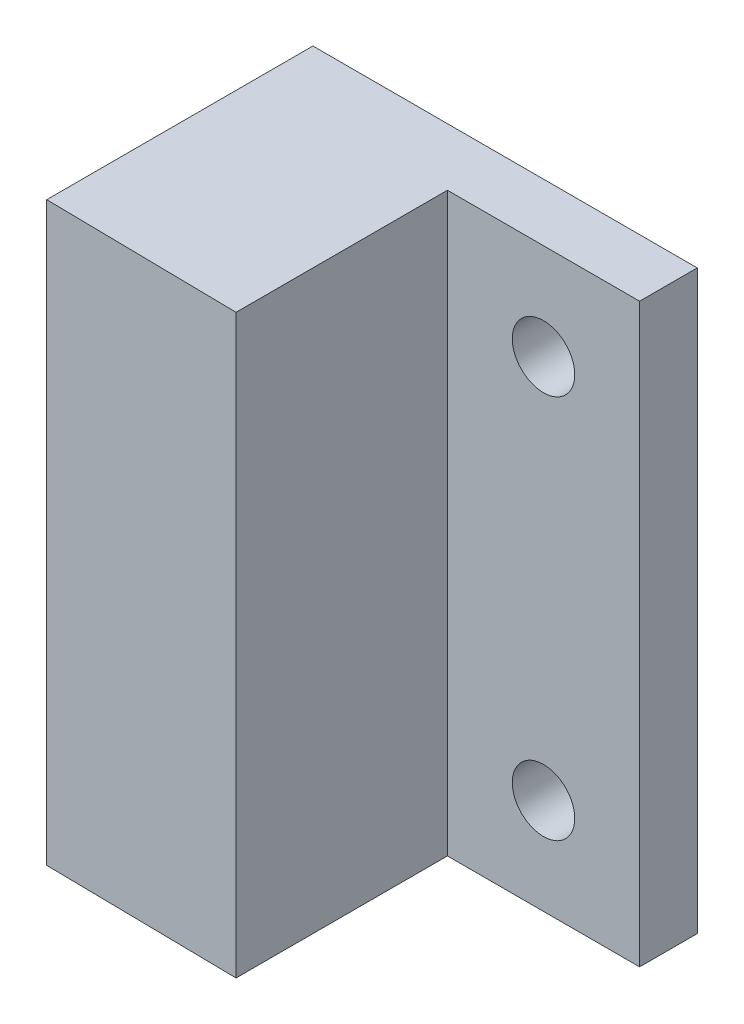
ISO-10303-21;
HEADER;
FILE_DESCRIPTION(('STEP AP214'),'2;1');
FILE_NAME('part.step','',(''),(''),'','','');
FILE_SCHEMA(('AUTOMOTIVE_DESIGN { 1 0 10303 214 1 1 1 1 }'));
ENDSEC;
DATA;
#1=APPLICATION_CONTEXT('core data for automotive mechanical design processes');
#2=APPLICATION_PROTOCOL_DEFINITION('international standard','automotive_design',2000,#1);
#3=PRODUCT_CONTEXT('',#1,'mechanical');
#4=PRODUCT('Part','Part','',(#3));
#5=PRODUCT_RELATED_PRODUCT_CATEGORY('part','',(#4));
#6=PRODUCT_DEFINITION_FORMATION('','',#4);
#7=PRODUCT_DEFINITION_CONTEXT('part definition',#1,'design');
#8=PRODUCT_DEFINITION('design','',#6,#7);
#9=PRODUCT_DEFINITION_SHAPE('','',#8);
#10=(LENGTH_UNIT() NAMED_UNIT(*) SI_UNIT(.MILLI.,.METRE.));
#11=(NAMED_UNIT(*) PLANE_ANGLE_UNIT() SI_UNIT($,.RADIAN.));
#12=(NAMED_UNIT(*) SI_UNIT($,.STERADIAN.) SOLID_ANGLE_UNIT());
#13=UNCERTAINTY_MEASURE_WITH_UNIT(LENGTH_MEASURE(1.E-05),#10,'distance_accuracy_value','');
#14=(GEOMETRIC_REPRESENTATION_CONTEXT(3) GLOBAL_UNCERTAINTY_ASSIGNED_CONTEXT((#13)) GLOBAL_UNIT_ASSIGNED_CONTEXT((#10,
#11,#12)) REPRESENTATION_CONTEXT('',''));
#15=CARTESIAN_POINT('',(0.,0.,0.));
#16=DIRECTION('',(0.,0.,1.));
#17=DIRECTION('',(1.,0.,0.));
#18=AXIS2_PLACEMENT_3D('',#15,#16,#17);
#19=CARTESIAN_POINT('',(10.,0.,14.));
#20=DIRECTION('',(-1.,0.,0.));
#21=DIRECTION('',(0.,-1.,0.));
#22=AXIS2_PLACEMENT_3D('',#19,#20,#21);
#23=PLANE('',#22);
#24=DIRECTION('',(0.,-1.,0.));
#25=VECTOR('',#24,1.);
#26=CARTESIAN_POINT('',(10.,0.,3.));
#27=LINE('',#26,#25);
#28=CARTESIAN_POINT('',(10.,0.,3.));
#29=VERTEX_POINT('',#28);
#30=CARTESIAN_POINT('',(10.,-30.,3.));
#31=VERTEX_POINT('',#30);
#32=EDGE_CURVE('E48',#29,#31,#27,.T.);
#33=ORIENTED_EDGE('',*,*,#32,.F.);
#34=DIRECTION('',(0.,0.,-1.));
#35=VECTOR('',#34,1.);
#36=CARTESIAN_POINT('',(10.,0.,14.));
#37=LINE('',#36,#35);
#38=CARTESIAN_POINT('',(10.,0.,14.));
#39=VERTEX_POINT('',#38);
#40=EDGE_CURVE('E102',#39,#29,#37,.T.);
#41=ORIENTED_EDGE('',*,*,#40,.F.);
#42=DIRECTION('',(0.,1.,0.));
#43=VECTOR('',#42,1.);
#44=CARTESIAN_POINT('',(10.,0.,14.));
#45=LINE('',#44,#43);
#46=CARTESIAN_POINT('',(10.,-30.,14.));
#47=VERTEX_POINT('',#46);
#48=EDGE_CURVE('E90',#47,#39,#45,.T.);
#49=ORIENTED_EDGE('',*,*,#48,.F.);
#50=DIRECTION('',(0.,0.,-1.));
#51=VECTOR('',#50,1.);
#52=CARTESIAN_POINT('',(10.,-30.,14.));
#53=LINE('',#52,#51);
#54=EDGE_CURVE('E41',#47,#31,#53,.T.);
#55=ORIENTED_EDGE('',*,*,#54,.T.);
#56=EDGE_LOOP('',(#33,#41,#49,#55));
#57=FACE_BOUND('',#56,.T.);
#58=ADVANCED_FACE('F33',(#57),#23,.F.);
#59=CARTESIAN_POINT('',(0.,0.,14.));
#60=DIRECTION('',(1.,0.,0.));
#61=DIRECTION('',(0.,1.,0.));
#62=AXIS2_PLACEMENT_3D('',#59,#60,#61);
#63=PLANE('',#62);
#64=DIRECTION('',(0.,0.,-1.));
#65=VECTOR('',#64,1.);
#66=CARTESIAN_POINT('',(0.,-30.,14.));
#67=LINE('',#66,#65);
#68=CARTESIAN_POINT('',(0.,-30.,13.85));
#69=VERTEX_POINT('',#68);
#70=CARTESIAN_POINT('',(0.,-30.,0.));
#71=VERTEX_POINT('',#70);
#72=EDGE_CURVE('E11',#69,#71,#67,.T.);
#73=ORIENTED_EDGE('',*,*,#72,.F.);
#74=DIRECTION('',(0.,-1.,0.));
#75=VECTOR('',#74,1.);
#76=CARTESIAN_POINT('',(0.,0.,13.85));
#77=LINE('',#76,#75);
#78=CARTESIAN_POINT('',(0.,0.,13.85));
#79=VERTEX_POINT('',#78);
#80=EDGE_CURVE('E105',#79,#69,#77,.T.);
#81=ORIENTED_EDGE('',*,*,#80,.F.);
#82=DIRECTION('',(0.,0.,-1.));
#83=VECTOR('',#82,1.);
#84=CARTESIAN_POINT('',(0.,0.,14.));
#85=LINE('',#84,#83);
#86=CARTESIAN_POINT('',(0.,0.,0.));
#87=VERTEX_POINT('',#86);
#88=EDGE_CURVE('E95',#79,#87,#85,.T.);
#89=ORIENTED_EDGE('',*,*,#88,.T.);
#90=DIRECTION('',(0.,-1.,0.));
#91=VECTOR('',#90,1.);
#92=CARTESIAN_POINT('',(0.,0.,0.));
#93=LINE('',#92,#91);
#94=EDGE_CURVE('E112',#87,#71,#93,.T.);
#95=ORIENTED_EDGE('',*,*,#94,.T.);
#96=EDGE_LOOP('',(#73,#81,#89,#95));
#97=FACE_BOUND('',#96,.T.);
#98=ADVANCED_FACE('F35',(#97),#63,.F.);
#99=CARTESIAN_POINT('',(0.,-30.,14.));
#100=DIRECTION('',(0.,1.,0.));
#101=DIRECTION('',(0.,0.,1.));
#102=AXIS2_PLACEMENT_3D('',#99,#100,#101);
#103=PLANE('',#102);
#104=ORIENTED_EDGE('',*,*,#54,.F.);
#105=DIRECTION('',(0.999887518980816,0.,0.0149983127847123));
#106=VECTOR('',#105,1.);
#107=CARTESIAN_POINT('',(0.,-30.,13.85));
#108=LINE('',#107,#106);
#109=EDGE_CURVE('E57',#69,#47,#108,.T.);
#110=ORIENTED_EDGE('',*,*,#109,.F.);
#111=ORIENTED_EDGE('',*,*,#72,.T.);
#112=DIRECTION('',(1.,0.,0.));
#113=VECTOR('',#112,1.);
#114=CARTESIAN_POINT('',(0.,-30.,0.));
#115=LINE('',#114,#113);
#116=CARTESIAN_POINT('',(20.,-30.,0.));
#117=VERTEX_POINT('',#116);
#118=EDGE_CURVE('E72',#71,#117,#115,.T.);
#119=ORIENTED_EDGE('',*,*,#118,.T.);
#120=DIRECTION('',(0.,0.,-1.));
#121=VECTOR('',#120,1.);
#122=CARTESIAN_POINT('',(20.,-30.,0.));
#123=LINE('',#122,#121);
#124=CARTESIAN_POINT('',(20.,-30.,3.));
#125=VERTEX_POINT('',#124);
#126=EDGE_CURVE('E120',#125,#117,#123,.T.);
#127=ORIENTED_EDGE('',*,*,#126,.F.);
#128=DIRECTION('',(-1.,0.,0.));
#129=VECTOR('',#128,1.);
#130=CARTESIAN_POINT('',(20.,-30.,3.));
#131=LINE('',#130,#129);
#132=EDGE_CURVE('E117',#125,#31,#131,.T.);
#133=ORIENTED_EDGE('',*,*,#132,.T.);
#134=EDGE_LOOP('',(#104,#110,#111,#119,#127,#133));
#135=FACE_BOUND('',#134,.T.);
#136=ADVANCED_FACE('F144',(#135),#103,.F.);
#137=CARTESIAN_POINT('',(0.,0.,14.));
#138=DIRECTION('',(0.,-1.,0.));
#139=DIRECTION('',(0.,0.,-1.));
#140=AXIS2_PLACEMENT_3D('',#137,#138,#139);
#141=PLANE('',#140);
#142=ORIENTED_EDGE('',*,*,#88,.F.);
#143=DIRECTION('',(0.999887518980816,0.,0.0149983127847123));
#144=VECTOR('',#143,1.);
#145=CARTESIAN_POINT('',(0.,0.,13.85));
#146=LINE('',#145,#144);
#147=EDGE_CURVE('E93',#79,#39,#146,.T.);
#148=ORIENTED_EDGE('',*,*,#147,.T.);
#149=ORIENTED_EDGE('',*,*,#40,.T.);
#150=DIRECTION('',(-1.,0.,0.));
#151=VECTOR('',#150,1.);
#152=CARTESIAN_POINT('',(20.,0.,3.));
#153=LINE('',#152,#151);
#154=CARTESIAN_POINT('',(20.,0.,3.));
#155=VERTEX_POINT('',#154);
#156=EDGE_CURVE('E114',#155,#29,#153,.T.);
#157=ORIENTED_EDGE('',*,*,#156,.F.);
#158=DIRECTION('',(0.,0.,1.));
#159=VECTOR('',#158,1.);
#160=CARTESIAN_POINT('',(20.,0.,0.));
#161=LINE('',#160,#159);
#162=CARTESIAN_POINT('',(20.,0.,0.));
#163=VERTEX_POINT('',#162);
#164=EDGE_CURVE('E127',#163,#155,#161,.T.);
#165=ORIENTED_EDGE('',*,*,#164,.F.);
#166=DIRECTION('',(-1.,0.,0.));
#167=VECTOR('',#166,1.);
#168=CARTESIAN_POINT('',(0.,0.,0.));
#169=LINE('',#168,#167);
#170=EDGE_CURVE('E96',#163,#87,#169,.T.);
#171=ORIENTED_EDGE('',*,*,#170,.T.);
#172=EDGE_LOOP('',(#142,#148,#149,#157,#165,#171));
#173=FACE_BOUND('',#172,.T.);
#174=ADVANCED_FACE('F100',(#173),#141,.F.);
#175=CARTESIAN_POINT('',(0.,0.,0.));
#176=DIRECTION('',(0.,0.,1.));
#177=DIRECTION('',(1.,0.,0.));
#178=AXIS2_PLACEMENT_3D('',#175,#176,#177);
#179=PLANE('',#178);
#180=CARTESIAN_POINT('',(15.,-5.,0.));
#181=DIRECTION('',(0.,0.,1.));
#182=DIRECTION('',(1.,0.,0.));
#183=AXIS2_PLACEMENT_3D('',#180,#181,#182);
#184=CIRCLE('',#183,1.625);
#185=CARTESIAN_POINT('',(16.625,-5.,0.));
#186=VERTEX_POINT('',#185);
#187=EDGE_CURVE('E123',#186,#186,#184,.T.);
#188=ORIENTED_EDGE('',*,*,#187,.T.);
#189=EDGE_LOOP('',(#188));
#190=FACE_BOUND('',#189,.T.);
#191=CARTESIAN_POINT('',(15.,-25.,0.));
#192=DIRECTION('',(0.,0.,1.));
#193=DIRECTION('',(1.,0.,0.));
#194=AXIS2_PLACEMENT_3D('',#191,#192,#193);
#195=CIRCLE('',#194,1.625);
#196=CARTESIAN_POINT('',(16.625,-25.,0.));
#197=VERTEX_POINT('',#196);
#198=EDGE_CURVE('E134',#197,#197,#195,.T.);
#199=ORIENTED_EDGE('',*,*,#198,.T.);
#200=EDGE_LOOP('',(#199));
#201=FACE_BOUND('',#200,.T.);
#202=ORIENTED_EDGE('',*,*,#94,.F.);
#203=ORIENTED_EDGE('',*,*,#170,.F.);
#204=DIRECTION('',(0.,1.,0.));
#205=VECTOR('',#204,1.);
#206=CARTESIAN_POINT('',(20.,0.,0.));
#207=LINE('',#206,#205);
#208=EDGE_CURVE('E122',#117,#163,#207,.T.);
#209=ORIENTED_EDGE('',*,*,#208,.F.);
#210=ORIENTED_EDGE('',*,*,#118,.F.);
#211=EDGE_LOOP('',(#202,#203,#209,#210));
#212=FACE_BOUND('',#211,.T.);
#213=ADVANCED_FACE('F147',(#190,#201,#212),#179,.F.);
#214=CARTESIAN_POINT('',(20.,0.,3.));
#215=DIRECTION('',(0.,0.,-1.));
#216=DIRECTION('',(0.,1.,0.));
#217=AXIS2_PLACEMENT_3D('',#214,#215,#216);
#218=PLANE('',#217);
#219=CARTESIAN_POINT('',(15.,-5.,3.));
#220=DIRECTION('',(0.,0.,1.));
#221=DIRECTION('',(1.,0.,0.));
#222=AXIS2_PLACEMENT_3D('',#219,#220,#221);
#223=CIRCLE('',#222,1.625);
#224=CARTESIAN_POINT('',(16.625,-5.,3.));
#225=VERTEX_POINT('',#224);
#226=EDGE_CURVE('E137',#225,#225,#223,.T.);
#227=ORIENTED_EDGE('',*,*,#226,.F.);
#228=EDGE_LOOP('',(#227));
#229=FACE_BOUND('',#228,.T.);
#230=CARTESIAN_POINT('',(15.,-25.,3.));
#231=DIRECTION('',(0.,0.,1.));
#232=DIRECTION('',(1.,0.,0.));
#233=AXIS2_PLACEMENT_3D('',#230,#231,#232);
#234=CIRCLE('',#233,1.625);
#235=CARTESIAN_POINT('',(16.625,-25.,3.));
#236=VERTEX_POINT('',#235);
#237=EDGE_CURVE('E131',#236,#236,#234,.T.);
#238=ORIENTED_EDGE('',*,*,#237,.F.);
#239=EDGE_LOOP('',(#238));
#240=FACE_BOUND('',#239,.T.);
#241=ORIENTED_EDGE('',*,*,#32,.T.);
#242=ORIENTED_EDGE('',*,*,#132,.F.);
#243=DIRECTION('',(0.,-1.,0.));
#244=VECTOR('',#243,1.);
#245=CARTESIAN_POINT('',(20.,0.,3.));
#246=LINE('',#245,#244);
#247=EDGE_CURVE('E125',#155,#125,#246,.T.);
#248=ORIENTED_EDGE('',*,*,#247,.F.);
#249=ORIENTED_EDGE('',*,*,#156,.T.);
#250=EDGE_LOOP('',(#241,#242,#248,#249));
#251=FACE_BOUND('',#250,.T.);
#252=ADVANCED_FACE('F155',(#229,#240,#251),#218,.F.);
#253=CARTESIAN_POINT('',(20.,0.,0.));
#254=DIRECTION('',(-1.,0.,0.));
#255=DIRECTION('',(0.,-1.,0.));
#256=AXIS2_PLACEMENT_3D('',#253,#254,#255);
#257=PLANE('',#256);
#258=ORIENTED_EDGE('',*,*,#208,.T.);
#259=ORIENTED_EDGE('',*,*,#164,.T.);
#260=ORIENTED_EDGE('',*,*,#247,.T.);
#261=ORIENTED_EDGE('',*,*,#126,.T.);
#262=EDGE_LOOP('',(#258,#259,#260,#261));
#263=FACE_BOUND('',#262,.T.);
#264=ADVANCED_FACE('F151',(#263),#257,.F.);
#265=CARTESIAN_POINT('',(15.,-25.,0.));
#266=DIRECTION('',(0.,0.,1.));
#267=DIRECTION('',(1.,0.,0.));
#268=AXIS2_PLACEMENT_3D('',#265,#266,#267);
#269=CYLINDRICAL_SURFACE('',#268,1.625);
#270=ORIENTED_EDGE('',*,*,#198,.F.);
#271=EDGE_LOOP('',(#270));
#272=FACE_BOUND('',#271,.T.);
#273=ORIENTED_EDGE('',*,*,#237,.T.);
#274=EDGE_LOOP('',(#273));
#275=FACE_BOUND('',#274,.T.);
#276=ADVANCED_FACE('F163',(#272,#275),#269,.F.);
#277=CARTESIAN_POINT('',(15.,-5.,0.));
#278=DIRECTION('',(0.,0.,1.));
#279=DIRECTION('',(1.,0.,0.));
#280=AXIS2_PLACEMENT_3D('',#277,#278,#279);
#281=CYLINDRICAL_SURFACE('',#280,1.625);
#282=ORIENTED_EDGE('',*,*,#187,.F.);
#283=EDGE_LOOP('',(#282));
#284=FACE_BOUND('',#283,.T.);
#285=ORIENTED_EDGE('',*,*,#226,.T.);
#286=EDGE_LOOP('',(#285));
#287=FACE_BOUND('',#286,.T.);
#288=ADVANCED_FACE('F203',(#284,#287),#281,.F.);
#289=CARTESIAN_POINT('',(0.,0.,13.85));
#290=DIRECTION('',(0.0149983127847123,0.,-0.999887518980816));
#291=DIRECTION('',(-0.999887518980816,0.,-0.0149983127847123));
#292=AXIS2_PLACEMENT_3D('',#289,#290,#291);
#293=PLANE('',#292);
#294=ORIENTED_EDGE('',*,*,#109,.T.);
#295=ORIENTED_EDGE('',*,*,#48,.T.);
#296=ORIENTED_EDGE('',*,*,#147,.F.);
#297=ORIENTED_EDGE('',*,*,#80,.T.);
#298=EDGE_LOOP('',(#294,#295,#296,#297));
#299=FACE_BOUND('',#298,.T.);
#300=ADVANCED_FACE('F92',(#299),#293,.F.);
#301=CLOSED_SHELL('',(#58,#98,#136,#174,#213,#252,#264,#276,#288,#300));
#302=MANIFOLD_SOLID_BREP('B2',#301);
#303=ADVANCED_BREP_SHAPE_REPRESENTATION('',(#18,#302),#14);
#304=SHAPE_DEFINITION_REPRESENTATION(#9,#303);
ENDSEC;
END-ISO-10303-21;
